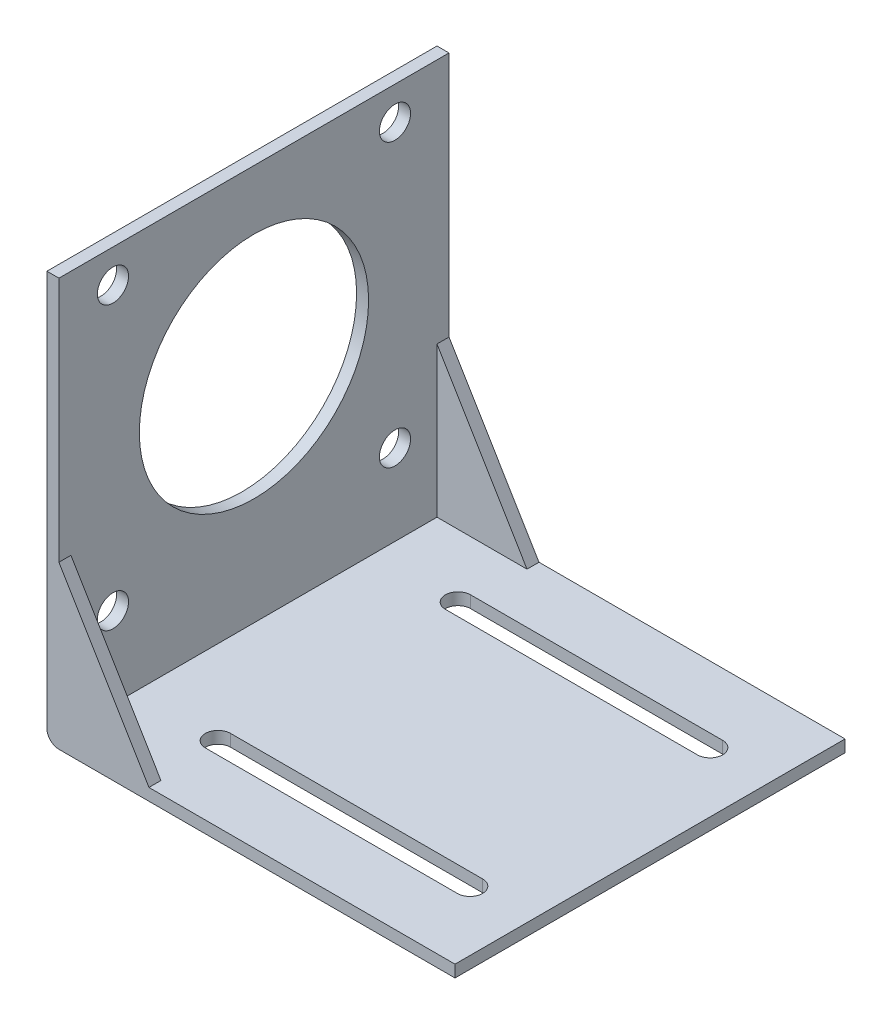
ISO-10303-21;
HEADER;
FILE_DESCRIPTION(('STEP AP214'),'2;1');
FILE_NAME('part.step','',(''),(''),'','','');
FILE_SCHEMA(('AUTOMOTIVE_DESIGN { 1 0 10303 214 1 1 1 1 }'));
ENDSEC;
DATA;
#1=APPLICATION_CONTEXT('core data for automotive mechanical design processes');
#2=APPLICATION_PROTOCOL_DEFINITION('international standard','automotive_design',2000,#1);
#3=PRODUCT_CONTEXT('',#1,'mechanical');
#4=PRODUCT('Part','Part','',(#3));
#5=PRODUCT_RELATED_PRODUCT_CATEGORY('part','',(#4));
#6=PRODUCT_DEFINITION_FORMATION('','',#4);
#7=PRODUCT_DEFINITION_CONTEXT('part definition',#1,'design');
#8=PRODUCT_DEFINITION('design','',#6,#7);
#9=PRODUCT_DEFINITION_SHAPE('','',#8);
#10=(LENGTH_UNIT() NAMED_UNIT(*) SI_UNIT(.MILLI.,.METRE.));
#11=(NAMED_UNIT(*) PLANE_ANGLE_UNIT() SI_UNIT($,.RADIAN.));
#12=(NAMED_UNIT(*) SI_UNIT($,.STERADIAN.) SOLID_ANGLE_UNIT());
#13=UNCERTAINTY_MEASURE_WITH_UNIT(LENGTH_MEASURE(1.E-05),#10,'distance_accuracy_value','');
#14=(GEOMETRIC_REPRESENTATION_CONTEXT(3) GLOBAL_UNCERTAINTY_ASSIGNED_CONTEXT((#13)) GLOBAL_UNIT_ASSIGNED_CONTEXT((#10,
#11,#12)) REPRESENTATION_CONTEXT('',''));
#15=CARTESIAN_POINT('',(0.,0.,0.));
#16=DIRECTION('',(0.,0.,1.));
#17=DIRECTION('',(1.,0.,0.));
#18=AXIS2_PLACEMENT_3D('',#15,#16,#17);
#19=CARTESIAN_POINT('',(2.,2.,65.));
#20=DIRECTION('',(0.,-1.,0.));
#21=DIRECTION('',(0.,0.,-1.));
#22=AXIS2_PLACEMENT_3D('',#19,#20,#21);
#23=PLANE('',#22);
#24=DIRECTION('',(1.,0.,0.));
#25=VECTOR('',#24,1.);
#26=CARTESIAN_POINT('',(16.,2.,54.6));
#27=LINE('',#26,#25);
#28=CARTESIAN_POINT('',(16.,2.,54.6));
#29=VERTEX_POINT('',#28);
#30=CARTESIAN_POINT('',(58.,2.,54.6));
#31=VERTEX_POINT('',#30);
#32=EDGE_CURVE('E217',#29,#31,#27,.T.);
#33=ORIENTED_EDGE('',*,*,#32,.F.);
#34=CARTESIAN_POINT('',(16.,2.,52.5));
#35=DIRECTION('',(0.,1.,0.));
#36=DIRECTION('',(0.,0.,1.));
#37=AXIS2_PLACEMENT_3D('',#34,#35,#36);
#38=CIRCLE('',#37,2.1);
#39=CARTESIAN_POINT('',(16.,2.,50.4));
#40=VERTEX_POINT('',#39);
#41=EDGE_CURVE('E200',#40,#29,#38,.T.);
#42=ORIENTED_EDGE('',*,*,#41,.F.);
#43=DIRECTION('',(-1.,0.,0.));
#44=VECTOR('',#43,1.);
#45=CARTESIAN_POINT('',(16.,2.,50.4));
#46=LINE('',#45,#44);
#47=CARTESIAN_POINT('',(58.,2.,50.4));
#48=VERTEX_POINT('',#47);
#49=EDGE_CURVE('E206',#48,#40,#46,.T.);
#50=ORIENTED_EDGE('',*,*,#49,.F.);
#51=CARTESIAN_POINT('',(58.,2.,52.5));
#52=DIRECTION('',(0.,1.,0.));
#53=DIRECTION('',(0.,0.,1.));
#54=AXIS2_PLACEMENT_3D('',#51,#52,#53);
#55=CIRCLE('',#54,2.1);
#56=EDGE_CURVE('E220',#31,#48,#55,.T.);
#57=ORIENTED_EDGE('',*,*,#56,.F.);
#58=EDGE_LOOP('',(#33,#42,#50,#57));
#59=FACE_BOUND('',#58,.T.);
#60=DIRECTION('',(1.,0.,0.));
#61=VECTOR('',#60,1.);
#62=CARTESIAN_POINT('',(16.,2.,14.6));
#63=LINE('',#62,#61);
#64=CARTESIAN_POINT('',(16.,2.,14.6));
#65=VERTEX_POINT('',#64);
#66=CARTESIAN_POINT('',(58.,2.,14.6));
#67=VERTEX_POINT('',#66);
#68=EDGE_CURVE('E249',#65,#67,#63,.T.);
#69=ORIENTED_EDGE('',*,*,#68,.F.);
#70=CARTESIAN_POINT('',(16.,2.,12.5));
#71=DIRECTION('',(0.,1.,0.));
#72=DIRECTION('',(0.,0.,1.));
#73=AXIS2_PLACEMENT_3D('',#70,#71,#72);
#74=CIRCLE('',#73,2.1);
#75=CARTESIAN_POINT('',(16.,2.,10.4));
#76=VERTEX_POINT('',#75);
#77=EDGE_CURVE('E227',#76,#65,#74,.T.);
#78=ORIENTED_EDGE('',*,*,#77,.F.);
#79=DIRECTION('',(-1.,0.,0.));
#80=VECTOR('',#79,1.);
#81=CARTESIAN_POINT('',(16.,2.,10.4));
#82=LINE('',#81,#80);
#83=CARTESIAN_POINT('',(58.,2.,10.4));
#84=VERTEX_POINT('',#83);
#85=EDGE_CURVE('E238',#84,#76,#82,.T.);
#86=ORIENTED_EDGE('',*,*,#85,.F.);
#87=CARTESIAN_POINT('',(58.,2.,12.5));
#88=DIRECTION('',(0.,1.,0.));
#89=DIRECTION('',(0.,0.,1.));
#90=AXIS2_PLACEMENT_3D('',#87,#88,#89);
#91=CIRCLE('',#90,2.1);
#92=EDGE_CURVE('E252',#67,#84,#91,.T.);
#93=ORIENTED_EDGE('',*,*,#92,.F.);
#94=EDGE_LOOP('',(#69,#78,#86,#93));
#95=FACE_BOUND('',#94,.T.);
#96=DIRECTION('',(-1.,0.,0.));
#97=VECTOR('',#96,1.);
#98=CARTESIAN_POINT('',(2.,2.,0.));
#99=LINE('',#98,#97);
#100=CARTESIAN_POINT('',(68.,2.,0.));
#101=VERTEX_POINT('',#100);
#102=CARTESIAN_POINT('',(17.,2.,0.));
#103=VERTEX_POINT('',#102);
#104=EDGE_CURVE('E293',#101,#103,#99,.T.);
#105=ORIENTED_EDGE('',*,*,#104,.T.);
#106=DIRECTION('',(0.,0.,-1.));
#107=VECTOR('',#106,1.);
#108=CARTESIAN_POINT('',(17.,2.,2.));
#109=LINE('',#108,#107);
#110=CARTESIAN_POINT('',(17.,2.,2.));
#111=VERTEX_POINT('',#110);
#112=EDGE_CURVE('E49',#111,#103,#109,.T.);
#113=ORIENTED_EDGE('',*,*,#112,.F.);
#114=DIRECTION('',(-1.,0.,0.));
#115=VECTOR('',#114,1.);
#116=CARTESIAN_POINT('',(17.,2.,2.));
#117=LINE('',#116,#115);
#118=CARTESIAN_POINT('',(2.,2.,2.));
#119=VERTEX_POINT('',#118);
#120=EDGE_CURVE('E181',#111,#119,#117,.T.);
#121=ORIENTED_EDGE('',*,*,#120,.T.);
#122=DIRECTION('',(0.,0.,-1.));
#123=VECTOR('',#122,1.);
#124=CARTESIAN_POINT('',(2.,2.,65.));
#125=LINE('',#124,#123);
#126=CARTESIAN_POINT('',(2.,2.,63.));
#127=VERTEX_POINT('',#126);
#128=EDGE_CURVE('E11',#127,#119,#125,.T.);
#129=ORIENTED_EDGE('',*,*,#128,.F.);
#130=DIRECTION('',(1.,0.,0.));
#131=VECTOR('',#130,1.);
#132=CARTESIAN_POINT('',(17.,2.,63.));
#133=LINE('',#132,#131);
#134=CARTESIAN_POINT('',(17.,2.,63.));
#135=VERTEX_POINT('',#134);
#136=EDGE_CURVE('E165',#127,#135,#133,.T.);
#137=ORIENTED_EDGE('',*,*,#136,.T.);
#138=DIRECTION('',(0.,0.,1.));
#139=VECTOR('',#138,1.);
#140=CARTESIAN_POINT('',(17.,2.,63.));
#141=LINE('',#140,#139);
#142=CARTESIAN_POINT('',(17.,2.,65.));
#143=VERTEX_POINT('',#142);
#144=EDGE_CURVE('E196',#135,#143,#141,.T.);
#145=ORIENTED_EDGE('',*,*,#144,.T.);
#146=DIRECTION('',(-1.,0.,0.));
#147=VECTOR('',#146,1.);
#148=CARTESIAN_POINT('',(2.,2.,65.));
#149=LINE('',#148,#147);
#150=CARTESIAN_POINT('',(68.,2.,65.));
#151=VERTEX_POINT('',#150);
#152=EDGE_CURVE('E296',#151,#143,#149,.T.);
#153=ORIENTED_EDGE('',*,*,#152,.F.);
#154=DIRECTION('',(0.,0.,-1.));
#155=VECTOR('',#154,1.);
#156=CARTESIAN_POINT('',(68.,2.,65.));
#157=LINE('',#156,#155);
#158=EDGE_CURVE('E312',#151,#101,#157,.T.);
#159=ORIENTED_EDGE('',*,*,#158,.T.);
#160=EDGE_LOOP('',(#105,#113,#121,#129,#137,#145,#153,#159));
#161=FACE_BOUND('',#160,.T.);
#162=ADVANCED_FACE('F35',(#59,#95,#161),#23,.F.);
#163=CARTESIAN_POINT('',(2.,68.,65.));
#164=DIRECTION('',(-1.,0.,0.));
#165=DIRECTION('',(0.,0.,1.));
#166=AXIS2_PLACEMENT_3D('',#163,#164,#165);
#167=PLANE('',#166);
#168=CARTESIAN_POINT('',(2.,62.5,56.));
#169=DIRECTION('',(1.,0.,0.));
#170=DIRECTION('',(0.,0.,-1.));
#171=AXIS2_PLACEMENT_3D('',#168,#169,#170);
#172=CIRCLE('',#171,2.6);
#173=CARTESIAN_POINT('',(2.,62.5,53.4));
#174=VERTEX_POINT('',#173);
#175=EDGE_CURVE('E259',#174,#174,#172,.T.);
#176=ORIENTED_EDGE('',*,*,#175,.F.);
#177=EDGE_LOOP('',(#176));
#178=FACE_BOUND('',#177,.T.);
#179=CARTESIAN_POINT('',(2.,15.5,56.));
#180=DIRECTION('',(1.,0.,0.));
#181=DIRECTION('',(0.,0.,-1.));
#182=AXIS2_PLACEMENT_3D('',#179,#180,#181);
#183=CIRCLE('',#182,2.6);
#184=CARTESIAN_POINT('',(2.,15.5,53.4));
#185=VERTEX_POINT('',#184);
#186=EDGE_CURVE('E269',#185,#185,#183,.T.);
#187=ORIENTED_EDGE('',*,*,#186,.F.);
#188=EDGE_LOOP('',(#187));
#189=FACE_BOUND('',#188,.T.);
#190=CARTESIAN_POINT('',(2.,15.5,9.00000000000001));
#191=DIRECTION('',(1.,0.,0.));
#192=DIRECTION('',(0.,0.,-1.));
#193=AXIS2_PLACEMENT_3D('',#190,#191,#192);
#194=CIRCLE('',#193,2.6);
#195=CARTESIAN_POINT('',(2.,15.5,6.40000000000001));
#196=VERTEX_POINT('',#195);
#197=EDGE_CURVE('E275',#196,#196,#194,.T.);
#198=ORIENTED_EDGE('',*,*,#197,.F.);
#199=EDGE_LOOP('',(#198));
#200=FACE_BOUND('',#199,.T.);
#201=CARTESIAN_POINT('',(2.,62.5,9.));
#202=DIRECTION('',(1.,0.,0.));
#203=DIRECTION('',(0.,0.,-1.));
#204=AXIS2_PLACEMENT_3D('',#201,#202,#203);
#205=CIRCLE('',#204,2.6);
#206=CARTESIAN_POINT('',(2.,62.5,6.4));
#207=VERTEX_POINT('',#206);
#208=EDGE_CURVE('E281',#207,#207,#205,.T.);
#209=ORIENTED_EDGE('',*,*,#208,.F.);
#210=EDGE_LOOP('',(#209));
#211=FACE_BOUND('',#210,.T.);
#212=CARTESIAN_POINT('',(2.,39.,32.5));
#213=DIRECTION('',(1.,0.,0.));
#214=DIRECTION('',(0.,0.,-1.));
#215=AXIS2_PLACEMENT_3D('',#212,#213,#214);
#216=CIRCLE('',#215,19.1);
#217=CARTESIAN_POINT('',(2.,39.,13.4));
#218=VERTEX_POINT('',#217);
#219=EDGE_CURVE('E287',#218,#218,#216,.T.);
#220=ORIENTED_EDGE('',*,*,#219,.F.);
#221=EDGE_LOOP('',(#220));
#222=FACE_BOUND('',#221,.T.);
#223=DIRECTION('',(0.,1.,0.));
#224=VECTOR('',#223,1.);
#225=CARTESIAN_POINT('',(2.,2.,2.));
#226=LINE('',#225,#224);
#227=CARTESIAN_POINT('',(2.,27.,2.));
#228=VERTEX_POINT('',#227);
#229=EDGE_CURVE('E56',#119,#228,#226,.T.);
#230=ORIENTED_EDGE('',*,*,#229,.T.);
#231=DIRECTION('',(0.,0.,-1.));
#232=VECTOR('',#231,1.);
#233=CARTESIAN_POINT('',(2.,27.,2.));
#234=LINE('',#233,#232);
#235=CARTESIAN_POINT('',(1.99999999999999,27.,0.));
#236=VERTEX_POINT('',#235);
#237=EDGE_CURVE('E184',#228,#236,#234,.T.);
#238=ORIENTED_EDGE('',*,*,#237,.T.);
#239=DIRECTION('',(0.,1.,0.));
#240=VECTOR('',#239,1.);
#241=CARTESIAN_POINT('',(2.,68.,0.));
#242=LINE('',#241,#240);
#243=CARTESIAN_POINT('',(2.,68.,0.));
#244=VERTEX_POINT('',#243);
#245=EDGE_CURVE('E314',#236,#244,#242,.T.);
#246=ORIENTED_EDGE('',*,*,#245,.T.);
#247=DIRECTION('',(0.,0.,-1.));
#248=VECTOR('',#247,1.);
#249=CARTESIAN_POINT('',(2.,68.,65.));
#250=LINE('',#249,#248);
#251=CARTESIAN_POINT('',(2.,68.,65.));
#252=VERTEX_POINT('',#251);
#253=EDGE_CURVE('E42',#252,#244,#250,.T.);
#254=ORIENTED_EDGE('',*,*,#253,.F.);
#255=DIRECTION('',(0.,1.,0.));
#256=VECTOR('',#255,1.);
#257=CARTESIAN_POINT('',(2.,68.,65.));
#258=LINE('',#257,#256);
#259=CARTESIAN_POINT('',(2.,27.,65.));
#260=VERTEX_POINT('',#259);
#261=EDGE_CURVE('E299',#260,#252,#258,.T.);
#262=ORIENTED_EDGE('',*,*,#261,.F.);
#263=DIRECTION('',(0.,0.,1.));
#264=VECTOR('',#263,1.);
#265=CARTESIAN_POINT('',(2.,27.,63.));
#266=LINE('',#265,#264);
#267=CARTESIAN_POINT('',(2.,27.,63.));
#268=VERTEX_POINT('',#267);
#269=EDGE_CURVE('E177',#268,#260,#266,.T.);
#270=ORIENTED_EDGE('',*,*,#269,.F.);
#271=DIRECTION('',(0.,-1.,0.));
#272=VECTOR('',#271,1.);
#273=CARTESIAN_POINT('',(2.,2.,63.));
#274=LINE('',#273,#272);
#275=EDGE_CURVE('E168',#268,#127,#274,.T.);
#276=ORIENTED_EDGE('',*,*,#275,.T.);
#277=ORIENTED_EDGE('',*,*,#128,.T.);
#278=EDGE_LOOP('',(#230,#238,#246,#254,#262,#270,#276,#277));
#279=FACE_BOUND('',#278,.T.);
#280=ADVANCED_FACE('F175',(#178,#189,#200,#211,#222,#279),#167,.F.);
#281=CARTESIAN_POINT('',(0.,68.,65.));
#282=DIRECTION('',(0.,-1.,0.));
#283=DIRECTION('',(0.,0.,-1.));
#284=AXIS2_PLACEMENT_3D('',#281,#282,#283);
#285=PLANE('',#284);
#286=DIRECTION('',(-1.,0.,0.));
#287=VECTOR('',#286,1.);
#288=CARTESIAN_POINT('',(0.,68.,0.));
#289=LINE('',#288,#287);
#290=CARTESIAN_POINT('',(0.,68.,0.));
#291=VERTEX_POINT('',#290);
#292=EDGE_CURVE('E316',#244,#291,#289,.T.);
#293=ORIENTED_EDGE('',*,*,#292,.T.);
#294=DIRECTION('',(0.,0.,-1.));
#295=VECTOR('',#294,1.);
#296=CARTESIAN_POINT('',(0.,68.,65.));
#297=LINE('',#296,#295);
#298=CARTESIAN_POINT('',(0.,68.,65.));
#299=VERTEX_POINT('',#298);
#300=EDGE_CURVE('E336',#299,#291,#297,.T.);
#301=ORIENTED_EDGE('',*,*,#300,.F.);
#302=DIRECTION('',(-1.,0.,0.));
#303=VECTOR('',#302,1.);
#304=CARTESIAN_POINT('',(0.,68.,65.));
#305=LINE('',#304,#303);
#306=EDGE_CURVE('E302',#252,#299,#305,.T.);
#307=ORIENTED_EDGE('',*,*,#306,.F.);
#308=ORIENTED_EDGE('',*,*,#253,.T.);
#309=EDGE_LOOP('',(#293,#301,#307,#308));
#310=FACE_BOUND('',#309,.T.);
#311=ADVANCED_FACE('F343',(#310),#285,.F.);
#312=CARTESIAN_POINT('',(0.,2.00000000000001,65.));
#313=DIRECTION('',(1.,0.,0.));
#314=DIRECTION('',(0.,0.,-1.));
#315=AXIS2_PLACEMENT_3D('',#312,#313,#314);
#316=PLANE('',#315);
#317=CARTESIAN_POINT('',(0.,62.5,56.));
#318=DIRECTION('',(1.,0.,0.));
#319=DIRECTION('',(0.,0.,-1.));
#320=AXIS2_PLACEMENT_3D('',#317,#318,#319);
#321=CIRCLE('',#320,2.6);
#322=CARTESIAN_POINT('',(0.,62.5,53.4));
#323=VERTEX_POINT('',#322);
#324=EDGE_CURVE('E266',#323,#323,#321,.T.);
#325=ORIENTED_EDGE('',*,*,#324,.T.);
#326=EDGE_LOOP('',(#325));
#327=FACE_BOUND('',#326,.T.);
#328=CARTESIAN_POINT('',(0.,15.5,56.));
#329=DIRECTION('',(1.,0.,0.));
#330=DIRECTION('',(0.,0.,-1.));
#331=AXIS2_PLACEMENT_3D('',#328,#329,#330);
#332=CIRCLE('',#331,2.6);
#333=CARTESIAN_POINT('',(0.,15.5,53.4));
#334=VERTEX_POINT('',#333);
#335=EDGE_CURVE('E272',#334,#334,#332,.T.);
#336=ORIENTED_EDGE('',*,*,#335,.T.);
#337=EDGE_LOOP('',(#336));
#338=FACE_BOUND('',#337,.T.);
#339=CARTESIAN_POINT('',(0.,15.5,9.00000000000001));
#340=DIRECTION('',(1.,0.,0.));
#341=DIRECTION('',(0.,0.,-1.));
#342=AXIS2_PLACEMENT_3D('',#339,#340,#341);
#343=CIRCLE('',#342,2.6);
#344=CARTESIAN_POINT('',(0.,15.5,6.40000000000001));
#345=VERTEX_POINT('',#344);
#346=EDGE_CURVE('E278',#345,#345,#343,.T.);
#347=ORIENTED_EDGE('',*,*,#346,.T.);
#348=EDGE_LOOP('',(#347));
#349=FACE_BOUND('',#348,.T.);
#350=CARTESIAN_POINT('',(0.,62.5,9.));
#351=DIRECTION('',(1.,0.,0.));
#352=DIRECTION('',(0.,0.,-1.));
#353=AXIS2_PLACEMENT_3D('',#350,#351,#352);
#354=CIRCLE('',#353,2.6);
#355=CARTESIAN_POINT('',(0.,62.5,6.4));
#356=VERTEX_POINT('',#355);
#357=EDGE_CURVE('E284',#356,#356,#354,.T.);
#358=ORIENTED_EDGE('',*,*,#357,.T.);
#359=EDGE_LOOP('',(#358));
#360=FACE_BOUND('',#359,.T.);
#361=CARTESIAN_POINT('',(0.,39.,32.5));
#362=DIRECTION('',(1.,0.,0.));
#363=DIRECTION('',(0.,0.,-1.));
#364=AXIS2_PLACEMENT_3D('',#361,#362,#363);
#365=CIRCLE('',#364,19.1);
#366=CARTESIAN_POINT('',(0.,39.,13.4));
#367=VERTEX_POINT('',#366);
#368=EDGE_CURVE('E290',#367,#367,#365,.T.);
#369=ORIENTED_EDGE('',*,*,#368,.T.);
#370=EDGE_LOOP('',(#369));
#371=FACE_BOUND('',#370,.T.);
#372=DIRECTION('',(0.,-1.,0.));
#373=VECTOR('',#372,1.);
#374=CARTESIAN_POINT('',(0.,2.00000000000001,0.));
#375=LINE('',#374,#373);
#376=CARTESIAN_POINT('',(0.,2.00000000000001,0.));
#377=VERTEX_POINT('',#376);
#378=EDGE_CURVE('E318',#291,#377,#375,.T.);
#379=ORIENTED_EDGE('',*,*,#378,.T.);
#380=DIRECTION('',(0.,0.,-1.));
#381=VECTOR('',#380,1.);
#382=CARTESIAN_POINT('',(0.,2.00000000000001,65.));
#383=LINE('',#382,#381);
#384=CARTESIAN_POINT('',(0.,2.00000000000001,65.));
#385=VERTEX_POINT('',#384);
#386=EDGE_CURVE('E333',#385,#377,#383,.T.);
#387=ORIENTED_EDGE('',*,*,#386,.F.);
#388=DIRECTION('',(0.,-1.,0.));
#389=VECTOR('',#388,1.);
#390=CARTESIAN_POINT('',(0.,2.00000000000001,65.));
#391=LINE('',#390,#389);
#392=EDGE_CURVE('E304',#299,#385,#391,.T.);
#393=ORIENTED_EDGE('',*,*,#392,.F.);
#394=ORIENTED_EDGE('',*,*,#300,.T.);
#395=EDGE_LOOP('',(#379,#387,#393,#394));
#396=FACE_BOUND('',#395,.T.);
#397=ADVANCED_FACE('F354',(#327,#338,#349,#360,#371,#396),#316,.F.);
#398=CARTESIAN_POINT('',(2.,2.,65.));
#399=DIRECTION('',(0.,0.,-1.));
#400=DIRECTION('',(-1.,0.,0.));
#401=AXIS2_PLACEMENT_3D('',#398,#399,#400);
#402=CYLINDRICAL_SURFACE('',#401,2.);
#403=CARTESIAN_POINT('',(2.,2.,0.));
#404=DIRECTION('',(0.,0.,1.));
#405=DIRECTION('',(-1.,0.,0.));
#406=AXIS2_PLACEMENT_3D('',#403,#404,#405);
#407=CIRCLE('',#406,2.);
#408=CARTESIAN_POINT('',(2.00000000000001,0.,0.));
#409=VERTEX_POINT('',#408);
#410=EDGE_CURVE('E320',#377,#409,#407,.T.);
#411=ORIENTED_EDGE('',*,*,#410,.T.);
#412=DIRECTION('',(0.,0.,-1.));
#413=VECTOR('',#412,1.);
#414=CARTESIAN_POINT('',(2.00000000000001,0.,65.));
#415=LINE('',#414,#413);
#416=CARTESIAN_POINT('',(2.00000000000001,0.,65.));
#417=VERTEX_POINT('',#416);
#418=EDGE_CURVE('E330',#417,#409,#415,.T.);
#419=ORIENTED_EDGE('',*,*,#418,.F.);
#420=CARTESIAN_POINT('',(2.,2.,65.));
#421=DIRECTION('',(0.,0.,1.));
#422=DIRECTION('',(-1.,0.,0.));
#423=AXIS2_PLACEMENT_3D('',#420,#421,#422);
#424=CIRCLE('',#423,2.);
#425=EDGE_CURVE('E306',#385,#417,#424,.T.);
#426=ORIENTED_EDGE('',*,*,#425,.F.);
#427=ORIENTED_EDGE('',*,*,#386,.T.);
#428=EDGE_LOOP('',(#411,#419,#426,#427));
#429=FACE_BOUND('',#428,.T.);
#430=ADVANCED_FACE('F358',(#429),#402,.T.);
#431=CARTESIAN_POINT('',(2.00000000000001,0.,65.));
#432=DIRECTION('',(0.,1.,0.));
#433=DIRECTION('',(0.,0.,1.));
#434=AXIS2_PLACEMENT_3D('',#431,#432,#433);
#435=PLANE('',#434);
#436=DIRECTION('',(-1.,0.,0.));
#437=VECTOR('',#436,1.);
#438=CARTESIAN_POINT('',(16.,0.,50.4));
#439=LINE('',#438,#437);
#440=CARTESIAN_POINT('',(58.,0.,50.4));
#441=VERTEX_POINT('',#440);
#442=CARTESIAN_POINT('',(16.,0.,50.4));
#443=VERTEX_POINT('',#442);
#444=EDGE_CURVE('E212',#441,#443,#439,.T.);
#445=ORIENTED_EDGE('',*,*,#444,.T.);
#446=CARTESIAN_POINT('',(16.,0.,52.5));
#447=DIRECTION('',(0.,1.,0.));
#448=DIRECTION('',(0.,0.,1.));
#449=AXIS2_PLACEMENT_3D('',#446,#447,#448);
#450=CIRCLE('',#449,2.1);
#451=CARTESIAN_POINT('',(16.,0.,54.6));
#452=VERTEX_POINT('',#451);
#453=EDGE_CURVE('E202',#443,#452,#450,.T.);
#454=ORIENTED_EDGE('',*,*,#453,.T.);
#455=DIRECTION('',(1.,0.,0.));
#456=VECTOR('',#455,1.);
#457=CARTESIAN_POINT('',(16.,0.,54.6));
#458=LINE('',#457,#456);
#459=CARTESIAN_POINT('',(58.,0.,54.6));
#460=VERTEX_POINT('',#459);
#461=EDGE_CURVE('E205',#452,#460,#458,.T.);
#462=ORIENTED_EDGE('',*,*,#461,.T.);
#463=CARTESIAN_POINT('',(58.,0.,52.5));
#464=DIRECTION('',(0.,1.,0.));
#465=DIRECTION('',(0.,0.,1.));
#466=AXIS2_PLACEMENT_3D('',#463,#464,#465);
#467=CIRCLE('',#466,2.1);
#468=EDGE_CURVE('E209',#460,#441,#467,.T.);
#469=ORIENTED_EDGE('',*,*,#468,.T.);
#470=EDGE_LOOP('',(#445,#454,#462,#469));
#471=FACE_BOUND('',#470,.T.);
#472=DIRECTION('',(-1.,0.,0.));
#473=VECTOR('',#472,1.);
#474=CARTESIAN_POINT('',(16.,0.,10.4));
#475=LINE('',#474,#473);
#476=CARTESIAN_POINT('',(58.,0.,10.4));
#477=VERTEX_POINT('',#476);
#478=CARTESIAN_POINT('',(16.,0.,10.4));
#479=VERTEX_POINT('',#478);
#480=EDGE_CURVE('E244',#477,#479,#475,.T.);
#481=ORIENTED_EDGE('',*,*,#480,.T.);
#482=CARTESIAN_POINT('',(16.,0.,12.5));
#483=DIRECTION('',(0.,1.,0.));
#484=DIRECTION('',(0.,0.,1.));
#485=AXIS2_PLACEMENT_3D('',#482,#483,#484);
#486=CIRCLE('',#485,2.1);
#487=CARTESIAN_POINT('',(16.,0.,14.6));
#488=VERTEX_POINT('',#487);
#489=EDGE_CURVE('E234',#479,#488,#486,.T.);
#490=ORIENTED_EDGE('',*,*,#489,.T.);
#491=DIRECTION('',(1.,0.,0.));
#492=VECTOR('',#491,1.);
#493=CARTESIAN_POINT('',(16.,0.,14.6));
#494=LINE('',#493,#492);
#495=CARTESIAN_POINT('',(58.,0.,14.6));
#496=VERTEX_POINT('',#495);
#497=EDGE_CURVE('E237',#488,#496,#494,.T.);
#498=ORIENTED_EDGE('',*,*,#497,.T.);
#499=CARTESIAN_POINT('',(58.,0.,12.5));
#500=DIRECTION('',(0.,1.,0.));
#501=DIRECTION('',(0.,0.,1.));
#502=AXIS2_PLACEMENT_3D('',#499,#500,#501);
#503=CIRCLE('',#502,2.1);
#504=EDGE_CURVE('E241',#496,#477,#503,.T.);
#505=ORIENTED_EDGE('',*,*,#504,.T.);
#506=EDGE_LOOP('',(#481,#490,#498,#505));
#507=FACE_BOUND('',#506,.T.);
#508=DIRECTION('',(1.,0.,0.));
#509=VECTOR('',#508,1.);
#510=CARTESIAN_POINT('',(2.00000000000001,0.,0.));
#511=LINE('',#510,#509);
#512=CARTESIAN_POINT('',(68.,0.,0.));
#513=VERTEX_POINT('',#512);
#514=EDGE_CURVE('E322',#409,#513,#511,.T.);
#515=ORIENTED_EDGE('',*,*,#514,.T.);
#516=DIRECTION('',(0.,0.,-1.));
#517=VECTOR('',#516,1.);
#518=CARTESIAN_POINT('',(68.,0.,65.));
#519=LINE('',#518,#517);
#520=CARTESIAN_POINT('',(68.,0.,65.));
#521=VERTEX_POINT('',#520);
#522=EDGE_CURVE('E327',#521,#513,#519,.T.);
#523=ORIENTED_EDGE('',*,*,#522,.F.);
#524=DIRECTION('',(1.,0.,0.));
#525=VECTOR('',#524,1.);
#526=CARTESIAN_POINT('',(2.00000000000001,0.,65.));
#527=LINE('',#526,#525);
#528=EDGE_CURVE('E308',#417,#521,#527,.T.);
#529=ORIENTED_EDGE('',*,*,#528,.F.);
#530=ORIENTED_EDGE('',*,*,#418,.T.);
#531=EDGE_LOOP('',(#515,#523,#529,#530));
#532=FACE_BOUND('',#531,.T.);
#533=ADVANCED_FACE('F408',(#471,#507,#532),#435,.F.);
#534=CARTESIAN_POINT('',(68.,2.,65.));
#535=DIRECTION('',(-1.,0.,0.));
#536=DIRECTION('',(0.,0.,1.));
#537=AXIS2_PLACEMENT_3D('',#534,#535,#536);
#538=PLANE('',#537);
#539=DIRECTION('',(0.,1.,0.));
#540=VECTOR('',#539,1.);
#541=CARTESIAN_POINT('',(68.,2.,0.));
#542=LINE('',#541,#540);
#543=EDGE_CURVE('E300',#513,#101,#542,.T.);
#544=ORIENTED_EDGE('',*,*,#543,.T.);
#545=ORIENTED_EDGE('',*,*,#158,.F.);
#546=DIRECTION('',(0.,1.,0.));
#547=VECTOR('',#546,1.);
#548=CARTESIAN_POINT('',(68.,2.,65.));
#549=LINE('',#548,#547);
#550=EDGE_CURVE('E310',#521,#151,#549,.T.);
#551=ORIENTED_EDGE('',*,*,#550,.F.);
#552=ORIENTED_EDGE('',*,*,#522,.T.);
#553=EDGE_LOOP('',(#544,#545,#551,#552));
#554=FACE_BOUND('',#553,.T.);
#555=ADVANCED_FACE('F411',(#554),#538,.F.);
#556=CARTESIAN_POINT('',(2.,2.,65.));
#557=DIRECTION('',(0.,0.,-1.));
#558=DIRECTION('',(-1.,0.,0.));
#559=AXIS2_PLACEMENT_3D('',#556,#557,#558);
#560=PLANE('',#559);
#561=DIRECTION('',(-0.514495755427527,0.857492925712544,0.));
#562=VECTOR('',#561,1.);
#563=CARTESIAN_POINT('',(2.,27.,65.));
#564=LINE('',#563,#562);
#565=EDGE_CURVE('E178',#143,#260,#564,.T.);
#566=ORIENTED_EDGE('',*,*,#565,.T.);
#567=ORIENTED_EDGE('',*,*,#261,.T.);
#568=ORIENTED_EDGE('',*,*,#306,.T.);
#569=ORIENTED_EDGE('',*,*,#392,.T.);
#570=ORIENTED_EDGE('',*,*,#425,.T.);
#571=ORIENTED_EDGE('',*,*,#528,.T.);
#572=ORIENTED_EDGE('',*,*,#550,.T.);
#573=ORIENTED_EDGE('',*,*,#152,.T.);
#574=EDGE_LOOP('',(#566,#567,#568,#569,#570,#571,#572,#573));
#575=FACE_BOUND('',#574,.T.);
#576=ADVANCED_FACE('F362',(#575),#560,.F.);
#577=CARTESIAN_POINT('',(2.,2.,0.));
#578=DIRECTION('',(0.,0.,-1.));
#579=DIRECTION('',(-1.,0.,0.));
#580=AXIS2_PLACEMENT_3D('',#577,#578,#579);
#581=PLANE('',#580);
#582=ORIENTED_EDGE('',*,*,#245,.F.);
#583=DIRECTION('',(0.514495755427527,-0.857492925712544,0.));
#584=VECTOR('',#583,1.);
#585=CARTESIAN_POINT('',(2.,27.,0.));
#586=LINE('',#585,#584);
#587=EDGE_CURVE('E191',#236,#103,#586,.T.);
#588=ORIENTED_EDGE('',*,*,#587,.T.);
#589=ORIENTED_EDGE('',*,*,#104,.F.);
#590=ORIENTED_EDGE('',*,*,#543,.F.);
#591=ORIENTED_EDGE('',*,*,#514,.F.);
#592=ORIENTED_EDGE('',*,*,#410,.F.);
#593=ORIENTED_EDGE('',*,*,#378,.F.);
#594=ORIENTED_EDGE('',*,*,#292,.F.);
#595=EDGE_LOOP('',(#582,#588,#589,#590,#591,#592,#593,#594));
#596=FACE_BOUND('',#595,.T.);
#597=ADVANCED_FACE('F348',(#596),#581,.T.);
#598=CARTESIAN_POINT('',(0.,39.,32.5));
#599=DIRECTION('',(1.,0.,0.));
#600=DIRECTION('',(0.,0.,-1.));
#601=AXIS2_PLACEMENT_3D('',#598,#599,#600);
#602=CYLINDRICAL_SURFACE('',#601,19.1);
#603=ORIENTED_EDGE('',*,*,#368,.F.);
#604=EDGE_LOOP('',(#603));
#605=FACE_BOUND('',#604,.T.);
#606=ORIENTED_EDGE('',*,*,#219,.T.);
#607=EDGE_LOOP('',(#606));
#608=FACE_BOUND('',#607,.T.);
#609=ADVANCED_FACE('F564',(#605,#608),#602,.F.);
#610=CARTESIAN_POINT('',(0.,62.5,9.));
#611=DIRECTION('',(1.,0.,0.));
#612=DIRECTION('',(0.,0.,-1.));
#613=AXIS2_PLACEMENT_3D('',#610,#611,#612);
#614=CYLINDRICAL_SURFACE('',#613,2.6);
#615=ORIENTED_EDGE('',*,*,#357,.F.);
#616=EDGE_LOOP('',(#615));
#617=FACE_BOUND('',#616,.T.);
#618=ORIENTED_EDGE('',*,*,#208,.T.);
#619=EDGE_LOOP('',(#618));
#620=FACE_BOUND('',#619,.T.);
#621=ADVANCED_FACE('F581',(#617,#620),#614,.F.);
#622=CARTESIAN_POINT('',(0.,15.5,9.00000000000001));
#623=DIRECTION('',(1.,0.,0.));
#624=DIRECTION('',(0.,0.,-1.));
#625=AXIS2_PLACEMENT_3D('',#622,#623,#624);
#626=CYLINDRICAL_SURFACE('',#625,2.6);
#627=ORIENTED_EDGE('',*,*,#346,.F.);
#628=EDGE_LOOP('',(#627));
#629=FACE_BOUND('',#628,.T.);
#630=ORIENTED_EDGE('',*,*,#197,.T.);
#631=EDGE_LOOP('',(#630));
#632=FACE_BOUND('',#631,.T.);
#633=ADVANCED_FACE('F589',(#629,#632),#626,.F.);
#634=CARTESIAN_POINT('',(0.,15.5,56.));
#635=DIRECTION('',(1.,0.,0.));
#636=DIRECTION('',(0.,0.,-1.));
#637=AXIS2_PLACEMENT_3D('',#634,#635,#636);
#638=CYLINDRICAL_SURFACE('',#637,2.6);
#639=ORIENTED_EDGE('',*,*,#335,.F.);
#640=EDGE_LOOP('',(#639));
#641=FACE_BOUND('',#640,.T.);
#642=ORIENTED_EDGE('',*,*,#186,.T.);
#643=EDGE_LOOP('',(#642));
#644=FACE_BOUND('',#643,.T.);
#645=ADVANCED_FACE('F597',(#641,#644),#638,.F.);
#646=CARTESIAN_POINT('',(0.,62.5,56.));
#647=DIRECTION('',(1.,0.,0.));
#648=DIRECTION('',(0.,0.,-1.));
#649=AXIS2_PLACEMENT_3D('',#646,#647,#648);
#650=CYLINDRICAL_SURFACE('',#649,2.6);
#651=ORIENTED_EDGE('',*,*,#324,.F.);
#652=EDGE_LOOP('',(#651));
#653=FACE_BOUND('',#652,.T.);
#654=ORIENTED_EDGE('',*,*,#175,.T.);
#655=EDGE_LOOP('',(#654));
#656=FACE_BOUND('',#655,.T.);
#657=ADVANCED_FACE('F452',(#653,#656),#650,.F.);
#658=CARTESIAN_POINT('',(16.,0.,12.5));
#659=DIRECTION('',(0.,1.,0.));
#660=DIRECTION('',(0.,0.,1.));
#661=AXIS2_PLACEMENT_3D('',#658,#659,#660);
#662=CYLINDRICAL_SURFACE('',#661,2.1);
#663=ORIENTED_EDGE('',*,*,#77,.T.);
#664=DIRECTION('',(0.,1.,0.));
#665=VECTOR('',#664,1.);
#666=CARTESIAN_POINT('',(16.,0.,14.6));
#667=LINE('',#666,#665);
#668=EDGE_CURVE('E247',#488,#65,#667,.T.);
#669=ORIENTED_EDGE('',*,*,#668,.F.);
#670=ORIENTED_EDGE('',*,*,#489,.F.);
#671=DIRECTION('',(0.,1.,0.));
#672=VECTOR('',#671,1.);
#673=CARTESIAN_POINT('',(16.,0.,10.4));
#674=LINE('',#673,#672);
#675=EDGE_CURVE('E257',#479,#76,#674,.T.);
#676=ORIENTED_EDGE('',*,*,#675,.T.);
#677=EDGE_LOOP('',(#663,#669,#670,#676));
#678=FACE_BOUND('',#677,.T.);
#679=ADVANCED_FACE('F401',(#678),#662,.F.);
#680=CARTESIAN_POINT('',(16.,0.,10.4));
#681=DIRECTION('',(0.,0.,-1.));
#682=DIRECTION('',(-1.,0.,0.));
#683=AXIS2_PLACEMENT_3D('',#680,#681,#682);
#684=PLANE('',#683);
#685=ORIENTED_EDGE('',*,*,#85,.T.);
#686=ORIENTED_EDGE('',*,*,#675,.F.);
#687=ORIENTED_EDGE('',*,*,#480,.F.);
#688=DIRECTION('',(0.,1.,0.));
#689=VECTOR('',#688,1.);
#690=CARTESIAN_POINT('',(58.,0.,10.4));
#691=LINE('',#690,#689);
#692=EDGE_CURVE('E260',#477,#84,#691,.T.);
#693=ORIENTED_EDGE('',*,*,#692,.T.);
#694=EDGE_LOOP('',(#685,#686,#687,#693));
#695=FACE_BOUND('',#694,.T.);
#696=ADVANCED_FACE('F404',(#695),#684,.F.);
#697=CARTESIAN_POINT('',(58.,0.,12.5));
#698=DIRECTION('',(0.,1.,0.));
#699=DIRECTION('',(0.,0.,1.));
#700=AXIS2_PLACEMENT_3D('',#697,#698,#699);
#701=CYLINDRICAL_SURFACE('',#700,2.1);
#702=ORIENTED_EDGE('',*,*,#92,.T.);
#703=ORIENTED_EDGE('',*,*,#692,.F.);
#704=ORIENTED_EDGE('',*,*,#504,.F.);
#705=DIRECTION('',(0.,1.,0.));
#706=VECTOR('',#705,1.);
#707=CARTESIAN_POINT('',(58.,0.,14.6));
#708=LINE('',#707,#706);
#709=EDGE_CURVE('E262',#496,#67,#708,.T.);
#710=ORIENTED_EDGE('',*,*,#709,.T.);
#711=EDGE_LOOP('',(#702,#703,#704,#710));
#712=FACE_BOUND('',#711,.T.);
#713=ADVANCED_FACE('F406',(#712),#701,.F.);
#714=CARTESIAN_POINT('',(16.,0.,14.6));
#715=DIRECTION('',(0.,0.,1.));
#716=DIRECTION('',(1.,0.,0.));
#717=AXIS2_PLACEMENT_3D('',#714,#715,#716);
#718=PLANE('',#717);
#719=ORIENTED_EDGE('',*,*,#68,.T.);
#720=ORIENTED_EDGE('',*,*,#709,.F.);
#721=ORIENTED_EDGE('',*,*,#497,.F.);
#722=ORIENTED_EDGE('',*,*,#668,.T.);
#723=EDGE_LOOP('',(#719,#720,#721,#722));
#724=FACE_BOUND('',#723,.T.);
#725=ADVANCED_FACE('F397',(#724),#718,.F.);
#726=CARTESIAN_POINT('',(16.,0.,52.5));
#727=DIRECTION('',(0.,1.,0.));
#728=DIRECTION('',(0.,0.,1.));
#729=AXIS2_PLACEMENT_3D('',#726,#727,#728);
#730=CYLINDRICAL_SURFACE('',#729,2.1);
#731=ORIENTED_EDGE('',*,*,#41,.T.);
#732=DIRECTION('',(0.,1.,0.));
#733=VECTOR('',#732,1.);
#734=CARTESIAN_POINT('',(16.,0.,54.6));
#735=LINE('',#734,#733);
#736=EDGE_CURVE('E215',#452,#29,#735,.T.);
#737=ORIENTED_EDGE('',*,*,#736,.F.);
#738=ORIENTED_EDGE('',*,*,#453,.F.);
#739=DIRECTION('',(0.,1.,0.));
#740=VECTOR('',#739,1.);
#741=CARTESIAN_POINT('',(16.,0.,50.4));
#742=LINE('',#741,#740);
#743=EDGE_CURVE('E225',#443,#40,#742,.T.);
#744=ORIENTED_EDGE('',*,*,#743,.T.);
#745=EDGE_LOOP('',(#731,#737,#738,#744));
#746=FACE_BOUND('',#745,.T.);
#747=ADVANCED_FACE('F485',(#746),#730,.F.);
#748=CARTESIAN_POINT('',(16.,0.,50.4));
#749=DIRECTION('',(0.,0.,-1.));
#750=DIRECTION('',(-1.,0.,0.));
#751=AXIS2_PLACEMENT_3D('',#748,#749,#750);
#752=PLANE('',#751);
#753=ORIENTED_EDGE('',*,*,#49,.T.);
#754=ORIENTED_EDGE('',*,*,#743,.F.);
#755=ORIENTED_EDGE('',*,*,#444,.F.);
#756=DIRECTION('',(0.,1.,0.));
#757=VECTOR('',#756,1.);
#758=CARTESIAN_POINT('',(58.,0.,50.4));
#759=LINE('',#758,#757);
#760=EDGE_CURVE('E228',#441,#48,#759,.T.);
#761=ORIENTED_EDGE('',*,*,#760,.T.);
#762=EDGE_LOOP('',(#753,#754,#755,#761));
#763=FACE_BOUND('',#762,.T.);
#764=ADVANCED_FACE('F494',(#763),#752,.F.);
#765=CARTESIAN_POINT('',(58.,0.,52.5));
#766=DIRECTION('',(0.,1.,0.));
#767=DIRECTION('',(0.,0.,1.));
#768=AXIS2_PLACEMENT_3D('',#765,#766,#767);
#769=CYLINDRICAL_SURFACE('',#768,2.1);
#770=ORIENTED_EDGE('',*,*,#56,.T.);
#771=ORIENTED_EDGE('',*,*,#760,.F.);
#772=ORIENTED_EDGE('',*,*,#468,.F.);
#773=DIRECTION('',(0.,1.,0.));
#774=VECTOR('',#773,1.);
#775=CARTESIAN_POINT('',(58.,0.,54.6));
#776=LINE('',#775,#774);
#777=EDGE_CURVE('E230',#460,#31,#776,.T.);
#778=ORIENTED_EDGE('',*,*,#777,.T.);
#779=EDGE_LOOP('',(#770,#771,#772,#778));
#780=FACE_BOUND('',#779,.T.);
#781=ADVANCED_FACE('F504',(#780),#769,.F.);
#782=CARTESIAN_POINT('',(16.,0.,54.6));
#783=DIRECTION('',(0.,0.,1.));
#784=DIRECTION('',(1.,0.,0.));
#785=AXIS2_PLACEMENT_3D('',#782,#783,#784);
#786=PLANE('',#785);
#787=ORIENTED_EDGE('',*,*,#32,.T.);
#788=ORIENTED_EDGE('',*,*,#777,.F.);
#789=ORIENTED_EDGE('',*,*,#461,.F.);
#790=ORIENTED_EDGE('',*,*,#736,.T.);
#791=EDGE_LOOP('',(#787,#788,#789,#790));
#792=FACE_BOUND('',#791,.T.);
#793=ADVANCED_FACE('F514',(#792),#786,.F.);
#794=CARTESIAN_POINT('',(2.,27.,63.));
#795=DIRECTION('',(0.857492925712544,0.514495755427527,0.));
#796=DIRECTION('',(-0.514495755427527,0.857492925712544,0.));
#797=AXIS2_PLACEMENT_3D('',#794,#795,#796);
#798=PLANE('',#797);
#799=ORIENTED_EDGE('',*,*,#565,.F.);
#800=ORIENTED_EDGE('',*,*,#144,.F.);
#801=DIRECTION('',(-0.514495755427527,0.857492925712544,0.));
#802=VECTOR('',#801,1.);
#803=CARTESIAN_POINT('',(2.,27.,63.));
#804=LINE('',#803,#802);
#805=EDGE_CURVE('E170',#135,#268,#804,.T.);
#806=ORIENTED_EDGE('',*,*,#805,.T.);
#807=ORIENTED_EDGE('',*,*,#269,.T.);
#808=EDGE_LOOP('',(#799,#800,#806,#807));
#809=FACE_BOUND('',#808,.T.);
#810=ADVANCED_FACE('F366',(#809),#798,.T.);
#811=CARTESIAN_POINT('',(0.,0.,63.));
#812=DIRECTION('',(0.,0.,1.));
#813=DIRECTION('',(1.,0.,0.));
#814=AXIS2_PLACEMENT_3D('',#811,#812,#813);
#815=PLANE('',#814);
#816=ORIENTED_EDGE('',*,*,#275,.F.);
#817=ORIENTED_EDGE('',*,*,#805,.F.);
#818=ORIENTED_EDGE('',*,*,#136,.F.);
#819=EDGE_LOOP('',(#816,#817,#818));
#820=FACE_BOUND('',#819,.T.);
#821=ADVANCED_FACE('F167',(#820),#815,.F.);
#822=CARTESIAN_POINT('',(2.,27.,2.));
#823=DIRECTION('',(0.857492925712544,0.514495755427527,0.));
#824=DIRECTION('',(-0.514495755427527,0.857492925712544,0.));
#825=AXIS2_PLACEMENT_3D('',#822,#823,#824);
#826=PLANE('',#825);
#827=ORIENTED_EDGE('',*,*,#587,.F.);
#828=ORIENTED_EDGE('',*,*,#237,.F.);
#829=DIRECTION('',(0.514495755427527,-0.857492925712544,0.));
#830=VECTOR('',#829,1.);
#831=CARTESIAN_POINT('',(2.,27.,2.));
#832=LINE('',#831,#830);
#833=EDGE_CURVE('E185',#228,#111,#832,.T.);
#834=ORIENTED_EDGE('',*,*,#833,.T.);
#835=ORIENTED_EDGE('',*,*,#112,.T.);
#836=EDGE_LOOP('',(#827,#828,#834,#835));
#837=FACE_BOUND('',#836,.T.);
#838=ADVANCED_FACE('F373',(#837),#826,.T.);
#839=CARTESIAN_POINT('',(0.,0.,2.));
#840=DIRECTION('',(0.,0.,1.));
#841=DIRECTION('',(1.,0.,0.));
#842=AXIS2_PLACEMENT_3D('',#839,#840,#841);
#843=PLANE('',#842);
#844=ORIENTED_EDGE('',*,*,#229,.F.);
#845=ORIENTED_EDGE('',*,*,#120,.F.);
#846=ORIENTED_EDGE('',*,*,#833,.F.);
#847=EDGE_LOOP('',(#844,#845,#846));
#848=FACE_BOUND('',#847,.T.);
#849=ADVANCED_FACE('F374',(#848),#843,.T.);
#850=CLOSED_SHELL('',(#162,#280,#311,#397,#430,#533,#555,#576,#597,#609,#621,#633,#645,#657,
#679,#696,#713,#725,#747,#764,#781,#793,#810,#821,#838,#849));
#851=MANIFOLD_SOLID_BREP('B2',#850);
#852=ADVANCED_BREP_SHAPE_REPRESENTATION('',(#18,#851),#14);
#853=SHAPE_DEFINITION_REPRESENTATION(#9,#852);
ENDSEC;
END-ISO-10303-21;
